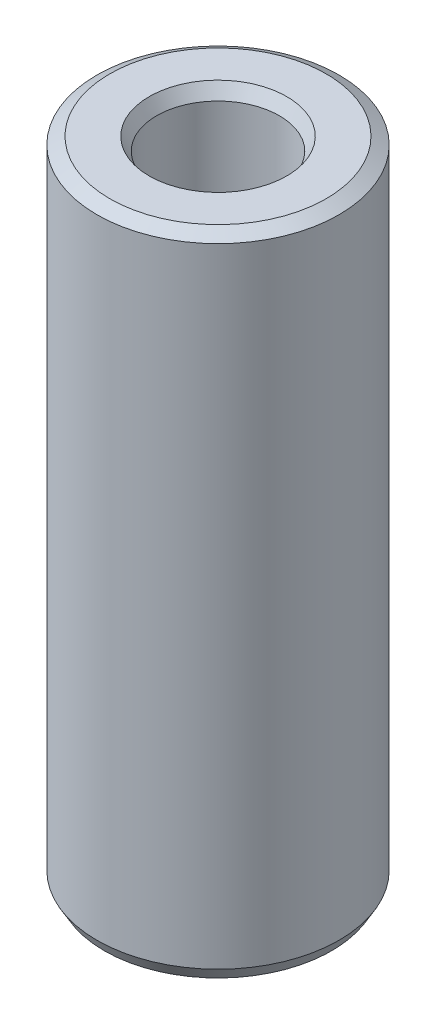
ISO-10303-21;
HEADER;
FILE_DESCRIPTION(('STEP AP214'),'2;1');
FILE_NAME('part.step','',(''),(''),'','','');
FILE_SCHEMA(('AUTOMOTIVE_DESIGN { 1 0 10303 214 1 1 1 1 }'));
ENDSEC;
DATA;
#1=APPLICATION_CONTEXT('core data for automotive mechanical design processes');
#2=APPLICATION_PROTOCOL_DEFINITION('international standard','automotive_design',2000,#1);
#3=PRODUCT_CONTEXT('',#1,'mechanical');
#4=PRODUCT('Part','Part','',(#3));
#5=PRODUCT_RELATED_PRODUCT_CATEGORY('part','',(#4));
#6=PRODUCT_DEFINITION_FORMATION('','',#4);
#7=PRODUCT_DEFINITION_CONTEXT('part definition',#1,'design');
#8=PRODUCT_DEFINITION('design','',#6,#7);
#9=PRODUCT_DEFINITION_SHAPE('','',#8);
#10=(LENGTH_UNIT() NAMED_UNIT(*) SI_UNIT(.MILLI.,.METRE.));
#11=(NAMED_UNIT(*) PLANE_ANGLE_UNIT() SI_UNIT($,.RADIAN.));
#12=(NAMED_UNIT(*) SI_UNIT($,.STERADIAN.) SOLID_ANGLE_UNIT());
#13=UNCERTAINTY_MEASURE_WITH_UNIT(LENGTH_MEASURE(1.E-05),#10,'distance_accuracy_value','');
#14=(GEOMETRIC_REPRESENTATION_CONTEXT(3) GLOBAL_UNCERTAINTY_ASSIGNED_CONTEXT((#13)) GLOBAL_UNIT_ASSIGNED_CONTEXT((#10,
#11,#12)) REPRESENTATION_CONTEXT('',''));
#15=CARTESIAN_POINT('',(0.,0.,0.));
#16=DIRECTION('',(0.,0.,1.));
#17=DIRECTION('',(1.,0.,0.));
#18=AXIS2_PLACEMENT_3D('',#15,#16,#17);
#19=CARTESIAN_POINT('',(0.,254.503893246219,0.));
#20=DIRECTION('',(0.,-1.,0.));
#21=DIRECTION('',(0.,0.,-1.));
#22=AXIS2_PLACEMENT_3D('',#19,#20,#21);
#23=CYLINDRICAL_SURFACE('',#22,47.5);
#24=CARTESIAN_POINT('',(0.,5.04240808560302,0.));
#25=DIRECTION('',(0.,1.,0.));
#26=DIRECTION('',(0.,0.,1.));
#27=AXIS2_PLACEMENT_3D('',#24,#25,#26);
#28=CIRCLE('',#27,47.5);
#29=CARTESIAN_POINT('',(0.,5.04240808560302,47.5));
#30=VERTEX_POINT('',#29);
#31=EDGE_CURVE('E10',#30,#30,#28,.T.);
#32=ORIENTED_EDGE('',*,*,#31,.T.);
#33=EDGE_LOOP('',(#32));
#34=FACE_BOUND('',#33,.T.);
#35=CARTESIAN_POINT('',(0.,251.592657580632,0.));
#36=DIRECTION('',(0.,1.,0.));
#37=DIRECTION('',(0.,0.,1.));
#38=AXIS2_PLACEMENT_3D('',#35,#36,#37);
#39=CIRCLE('',#38,47.5);
#40=CARTESIAN_POINT('',(0.,251.592657580632,47.5));
#41=VERTEX_POINT('',#40);
#42=EDGE_CURVE('E50',#41,#41,#39,.F.);
#43=ORIENTED_EDGE('',*,*,#42,.T.);
#44=EDGE_LOOP('',(#43));
#45=FACE_BOUND('',#44,.T.);
#46=ADVANCED_FACE('F39',(#34,#45),#23,.T.);
#47=CARTESIAN_POINT('',(0.,254.503893246219,0.));
#48=DIRECTION('',(0.,1.,0.));
#49=DIRECTION('',(0.,0.,1.));
#50=AXIS2_PLACEMENT_3D('',#47,#48,#49);
#51=PLANE('',#50);
#52=CARTESIAN_POINT('',(0.,254.503893246219,0.));
#53=DIRECTION('',(0.,1.,0.));
#54=DIRECTION('',(0.,0.,1.));
#55=AXIS2_PLACEMENT_3D('',#52,#53,#54);
#56=CIRCLE('',#55,26.9933985025265);
#57=CARTESIAN_POINT('',(0.,254.503893246219,26.9933985025265));
#58=VERTEX_POINT('',#57);
#59=EDGE_CURVE('E58',#58,#58,#56,.F.);
#60=ORIENTED_EDGE('',*,*,#59,.T.);
#61=EDGE_LOOP('',(#60));
#62=FACE_BOUND('',#61,.T.);
#63=CARTESIAN_POINT('',(0.,254.503893246219,0.));
#64=DIRECTION('',(0.,1.,0.));
#65=DIRECTION('',(0.,0.,1.));
#66=AXIS2_PLACEMENT_3D('',#63,#64,#65);
#67=CIRCLE('',#66,42.4575919143969);
#68=CARTESIAN_POINT('',(0.,254.503893246219,42.4575919143969));
#69=VERTEX_POINT('',#68);
#70=EDGE_CURVE('E61',#69,#69,#67,.T.);
#71=ORIENTED_EDGE('',*,*,#70,.T.);
#72=EDGE_LOOP('',(#71));
#73=FACE_BOUND('',#72,.T.);
#74=ADVANCED_FACE('F88',(#62,#73),#51,.T.);
#75=CARTESIAN_POINT('',(0.,0.,0.));
#76=DIRECTION('',(0.,1.,0.));
#77=DIRECTION('',(0.,0.,1.));
#78=AXIS2_PLACEMENT_3D('',#75,#76,#77);
#79=PLANE('',#78);
#80=CARTESIAN_POINT('',(0.,0.,0.));
#81=DIRECTION('',(0.,1.,0.));
#82=DIRECTION('',(0.,0.,1.));
#83=AXIS2_PLACEMENT_3D('',#80,#81,#82);
#84=CIRCLE('',#83,29.1245709225427);
#85=CARTESIAN_POINT('',(0.,0.,29.1245709225427));
#86=VERTEX_POINT('',#85);
#87=EDGE_CURVE('E51',#86,#86,#84,.T.);
#88=ORIENTED_EDGE('',*,*,#87,.T.);
#89=EDGE_LOOP('',(#88));
#90=FACE_BOUND('',#89,.T.);
#91=CARTESIAN_POINT('',(0.,0.,0.));
#92=DIRECTION('',(0.,1.,0.));
#93=DIRECTION('',(0.,0.,1.));
#94=AXIS2_PLACEMENT_3D('',#91,#92,#93);
#95=CIRCLE('',#94,44.5887643344132);
#96=CARTESIAN_POINT('',(0.,0.,44.5887643344132));
#97=VERTEX_POINT('',#96);
#98=EDGE_CURVE('E54',#97,#97,#95,.F.);
#99=ORIENTED_EDGE('',*,*,#98,.T.);
#100=EDGE_LOOP('',(#99));
#101=FACE_BOUND('',#100,.T.);
#102=ADVANCED_FACE('F83',(#90,#101),#79,.F.);
#103=CARTESIAN_POINT('',(0.,254.503893246219,0.));
#104=DIRECTION('',(0.,-1.,0.));
#105=DIRECTION('',(0.,0.,-1.));
#106=AXIS2_PLACEMENT_3D('',#103,#104,#105);
#107=CYLINDRICAL_SURFACE('',#106,24.0821628369397);
#108=CARTESIAN_POINT('',(0.,249.461485160616,0.));
#109=DIRECTION('',(0.,1.,0.));
#110=DIRECTION('',(0.,0.,1.));
#111=AXIS2_PLACEMENT_3D('',#108,#109,#110);
#112=CIRCLE('',#111,24.0821628369397);
#113=CARTESIAN_POINT('',(0.,249.461485160616,24.0821628369397));
#114=VERTEX_POINT('',#113);
#115=EDGE_CURVE('E67',#114,#114,#112,.T.);
#116=ORIENTED_EDGE('',*,*,#115,.T.);
#117=EDGE_LOOP('',(#116));
#118=FACE_BOUND('',#117,.T.);
#119=CARTESIAN_POINT('',(0.,2.91123566558688,0.));
#120=DIRECTION('',(0.,1.,0.));
#121=DIRECTION('',(0.,0.,1.));
#122=AXIS2_PLACEMENT_3D('',#119,#120,#121);
#123=CIRCLE('',#122,24.0821628369397);
#124=CARTESIAN_POINT('',(0.,2.91123566558688,24.0821628369397));
#125=VERTEX_POINT('',#124);
#126=EDGE_CURVE('E69',#125,#125,#123,.F.);
#127=ORIENTED_EDGE('',*,*,#126,.T.);
#128=EDGE_LOOP('',(#127));
#129=FACE_BOUND('',#128,.T.);
#130=ADVANCED_FACE('F71',(#118,#129),#107,.F.);
#131=CARTESIAN_POINT('',(0.,249.461485160616,0.));
#132=DIRECTION('',(0.,1.,0.));
#133=DIRECTION('',(0.,0.,1.));
#134=AXIS2_PLACEMENT_3D('',#131,#132,#133);
#135=CONICAL_SURFACE('',#134,24.0821628369397,0.523598775598297);
#136=ORIENTED_EDGE('',*,*,#59,.F.);
#137=EDGE_LOOP('',(#136));
#138=FACE_BOUND('',#137,.T.);
#139=ORIENTED_EDGE('',*,*,#115,.F.);
#140=EDGE_LOOP('',(#139));
#141=FACE_BOUND('',#140,.T.);
#142=ADVANCED_FACE('F77',(#138,#141),#135,.F.);
#143=CARTESIAN_POINT('',(0.,0.,0.));
#144=DIRECTION('',(0.,-1.,0.));
#145=DIRECTION('',(0.,0.,-1.));
#146=AXIS2_PLACEMENT_3D('',#143,#144,#145);
#147=CONICAL_SURFACE('',#146,29.1245709225427,1.04719755119659);
#148=ORIENTED_EDGE('',*,*,#126,.F.);
#149=EDGE_LOOP('',(#148));
#150=FACE_BOUND('',#149,.T.);
#151=ORIENTED_EDGE('',*,*,#87,.F.);
#152=EDGE_LOOP('',(#151));
#153=FACE_BOUND('',#152,.T.);
#154=ADVANCED_FACE('F73',(#150,#153),#147,.F.);
#155=CARTESIAN_POINT('',(0.,5.04240808560302,0.));
#156=DIRECTION('',(0.,1.,0.));
#157=DIRECTION('',(0.,0.,1.));
#158=AXIS2_PLACEMENT_3D('',#155,#156,#157);
#159=CONICAL_SURFACE('',#158,47.5,0.523598775598299);
#160=ORIENTED_EDGE('',*,*,#98,.F.);
#161=EDGE_LOOP('',(#160));
#162=FACE_BOUND('',#161,.T.);
#163=ORIENTED_EDGE('',*,*,#31,.F.);
#164=EDGE_LOOP('',(#163));
#165=FACE_BOUND('',#164,.T.);
#166=ADVANCED_FACE('F76',(#162,#165),#159,.T.);
#167=CARTESIAN_POINT('',(0.,254.503893246219,0.));
#168=DIRECTION('',(0.,-1.,0.));
#169=DIRECTION('',(0.,0.,-1.));
#170=AXIS2_PLACEMENT_3D('',#167,#168,#169);
#171=CONICAL_SURFACE('',#170,42.4575919143969,1.04719755119661);
#172=ORIENTED_EDGE('',*,*,#42,.F.);
#173=EDGE_LOOP('',(#172));
#174=FACE_BOUND('',#173,.T.);
#175=ORIENTED_EDGE('',*,*,#70,.F.);
#176=EDGE_LOOP('',(#175));
#177=FACE_BOUND('',#176,.T.);
#178=ADVANCED_FACE('F45',(#174,#177),#171,.T.);
#179=CLOSED_SHELL('',(#46,#74,#102,#130,#142,#154,#166,#178));
#180=MANIFOLD_SOLID_BREP('B2',#179);
#181=ADVANCED_BREP_SHAPE_REPRESENTATION('',(#18,#180),#14);
#182=SHAPE_DEFINITION_REPRESENTATION(#9,#181);
ENDSEC;
END-ISO-10303-21;
